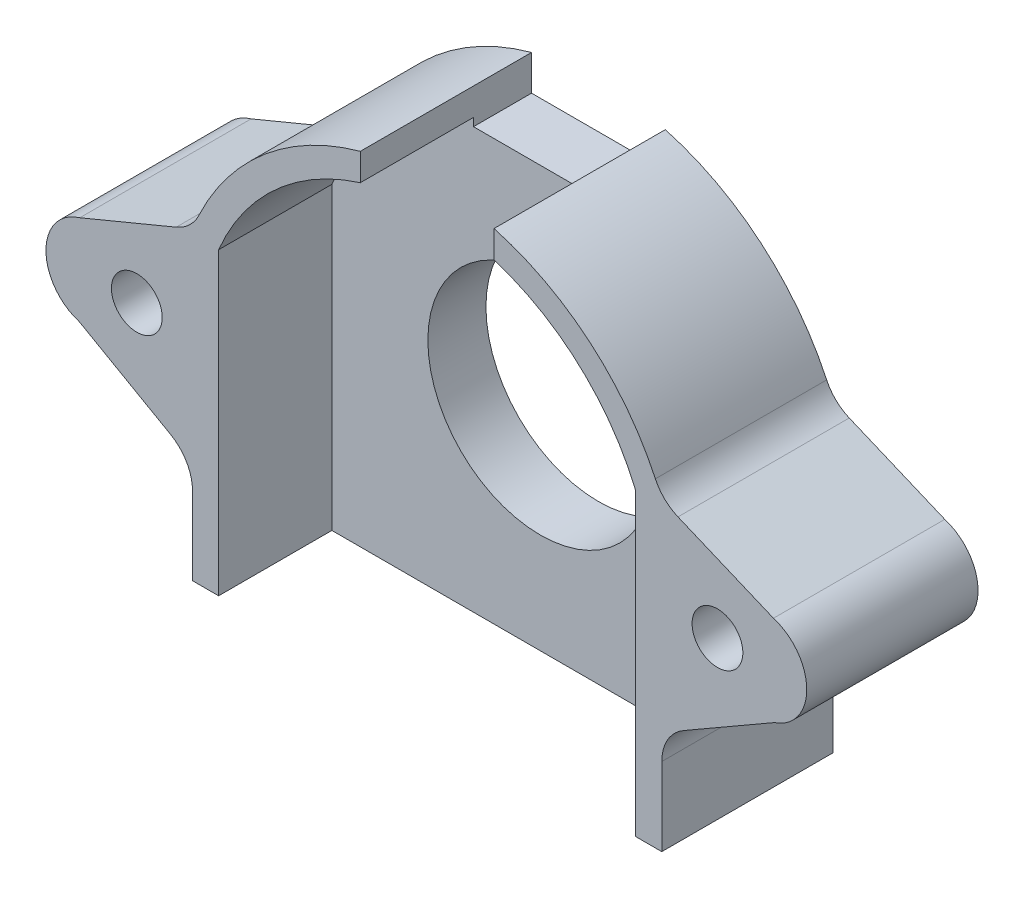
ISO-10303-21;
HEADER;
FILE_DESCRIPTION(('STEP AP214'),'2;1');
FILE_NAME('part.step','',(''),(''),'','','');
FILE_SCHEMA(('AUTOMOTIVE_DESIGN { 1 0 10303 214 1 1 1 1 }'));
ENDSEC;
DATA;
#1=APPLICATION_CONTEXT('core data for automotive mechanical design processes');
#2=APPLICATION_PROTOCOL_DEFINITION('international standard','automotive_design',2000,#1);
#3=PRODUCT_CONTEXT('',#1,'mechanical');
#4=PRODUCT('Part','Part','',(#3));
#5=PRODUCT_RELATED_PRODUCT_CATEGORY('part','',(#4));
#6=PRODUCT_DEFINITION_FORMATION('','',#4);
#7=PRODUCT_DEFINITION_CONTEXT('part definition',#1,'design');
#8=PRODUCT_DEFINITION('design','',#6,#7);
#9=PRODUCT_DEFINITION_SHAPE('','',#8);
#10=(LENGTH_UNIT() NAMED_UNIT(*) SI_UNIT(.MILLI.,.METRE.));
#11=(NAMED_UNIT(*) PLANE_ANGLE_UNIT() SI_UNIT($,.RADIAN.));
#12=(NAMED_UNIT(*) SI_UNIT($,.STERADIAN.) SOLID_ANGLE_UNIT());
#13=UNCERTAINTY_MEASURE_WITH_UNIT(LENGTH_MEASURE(1.E-05),#10,'distance_accuracy_value','');
#14=(GEOMETRIC_REPRESENTATION_CONTEXT(3) GLOBAL_UNCERTAINTY_ASSIGNED_CONTEXT((#13)) GLOBAL_UNIT_ASSIGNED_CONTEXT((#10,
#11,#12)) REPRESENTATION_CONTEXT('',''));
#15=CARTESIAN_POINT('',(0.,0.,0.));
#16=DIRECTION('',(0.,0.,1.));
#17=DIRECTION('',(1.,0.,0.));
#18=AXIS2_PLACEMENT_3D('',#15,#16,#17);
#19=CARTESIAN_POINT('',(-16.1638504935599,6.34296785302776,4.));
#20=DIRECTION('',(1.,0.,0.));
#21=DIRECTION('',(0.,0.,-1.));
#22=AXIS2_PLACEMENT_3D('',#19,#20,#21);
#23=PLANE('',#22);
#24=DIRECTION('',(0.,0.,1.));
#25=VECTOR('',#24,1.);
#26=CARTESIAN_POINT('',(-16.1638504935599,-9.28714517687184,4.));
#27=LINE('',#26,#25);
#28=CARTESIAN_POINT('',(-16.1638504935599,-9.28714517687184,11.8));
#29=VERTEX_POINT('',#28);
#30=CARTESIAN_POINT('',(-16.1638504935599,-9.28714517687184,0.));
#31=VERTEX_POINT('',#30);
#32=EDGE_CURVE('E56',#29,#31,#27,.F.);
#33=ORIENTED_EDGE('',*,*,#32,.T.);
#34=DIRECTION('',(0.,-1.,0.));
#35=VECTOR('',#34,1.);
#36=CARTESIAN_POINT('',(-16.1638504935599,6.34296785302776,0.));
#37=LINE('',#36,#35);
#38=CARTESIAN_POINT('',(-16.1638504935599,-14.6559029883289,0.));
#39=VERTEX_POINT('',#38);
#40=EDGE_CURVE('E193',#31,#39,#37,.T.);
#41=ORIENTED_EDGE('',*,*,#40,.T.);
#42=DIRECTION('',(0.,0.,-1.));
#43=VECTOR('',#42,1.);
#44=CARTESIAN_POINT('',(-16.1638504935599,-14.6559029883289,11.8));
#45=LINE('',#44,#43);
#46=CARTESIAN_POINT('',(-16.1638504935599,-14.6559029883289,11.8));
#47=VERTEX_POINT('',#46);
#48=EDGE_CURVE('E196',#47,#39,#45,.T.);
#49=ORIENTED_EDGE('',*,*,#48,.F.);
#50=DIRECTION('',(0.,-1.,0.));
#51=VECTOR('',#50,1.);
#52=CARTESIAN_POINT('',(-16.1638504935599,6.34296785302776,11.8));
#53=LINE('',#52,#51);
#54=EDGE_CURVE('E364',#29,#47,#53,.T.);
#55=ORIENTED_EDGE('',*,*,#54,.F.);
#56=EDGE_LOOP('',(#33,#41,#49,#55));
#57=FACE_BOUND('',#56,.T.);
#58=ADVANCED_FACE('F33',(#57),#23,.F.);
#59=CARTESIAN_POINT('',(0.,0.,4.));
#60=DIRECTION('',(0.,0.,-1.));
#61=DIRECTION('',(-1.,0.,0.));
#62=AXIS2_PLACEMENT_3D('',#59,#60,#61);
#63=CYLINDRICAL_SURFACE('',#62,17.3638504935599);
#64=DIRECTION('',(0.,0.,-1.));
#65=VECTOR('',#64,1.);
#66=CARTESIAN_POINT('',(15.7225991631552,7.36906910793018,4.));
#67=LINE('',#66,#65);
#68=CARTESIAN_POINT('',(15.7225991631552,7.36906910793018,11.8));
#69=VERTEX_POINT('',#68);
#70=CARTESIAN_POINT('',(15.7225991631552,7.36906910793018,0.));
#71=VERTEX_POINT('',#70);
#72=EDGE_CURVE('E392',#69,#71,#67,.T.);
#73=ORIENTED_EDGE('',*,*,#72,.T.);
#74=CARTESIAN_POINT('',(0.,0.,0.));
#75=DIRECTION('',(0.,0.,1.));
#76=DIRECTION('',(1.,0.,0.));
#77=AXIS2_PLACEMENT_3D('',#74,#75,#76);
#78=CIRCLE('',#77,17.3638504935599);
#79=CARTESIAN_POINT('',(4.6066267409119,16.7416335532891,0.));
#80=VERTEX_POINT('',#79);
#81=EDGE_CURVE('E371',#71,#80,#78,.T.);
#82=ORIENTED_EDGE('',*,*,#81,.T.);
#83=DIRECTION('',(0.,0.,-1.));
#84=VECTOR('',#83,1.);
#85=CARTESIAN_POINT('',(4.6066267409119,16.7416335532891,11.8));
#86=LINE('',#85,#84);
#87=CARTESIAN_POINT('',(4.6066267409119,16.7416335532891,11.8));
#88=VERTEX_POINT('',#87);
#89=EDGE_CURVE('E322',#88,#80,#86,.T.);
#90=ORIENTED_EDGE('',*,*,#89,.F.);
#91=CARTESIAN_POINT('',(0.,0.,11.8));
#92=DIRECTION('',(0.,0.,1.));
#93=DIRECTION('',(1.,0.,0.));
#94=AXIS2_PLACEMENT_3D('',#91,#92,#93);
#95=CIRCLE('',#94,17.3638504935599);
#96=EDGE_CURVE('E359',#69,#88,#95,.T.);
#97=ORIENTED_EDGE('',*,*,#96,.F.);
#98=EDGE_LOOP('',(#73,#82,#90,#97));
#99=FACE_BOUND('',#98,.T.);
#100=ADVANCED_FACE('F424',(#99),#63,.T.);
#101=CARTESIAN_POINT('',(0.,0.,11.8));
#102=DIRECTION('',(0.,0.,1.));
#103=DIRECTION('',(1.,0.,0.));
#104=AXIS2_PLACEMENT_3D('',#101,#102,#103);
#105=PLANE('',#104);
#106=DIRECTION('',(0.,-1.,0.));
#107=VECTOR('',#106,1.);
#108=CARTESIAN_POINT('',(4.6066267409119,14.6569741781302,11.8));
#109=LINE('',#108,#107);
#110=CARTESIAN_POINT('',(4.6066267409119,14.8664868834503,11.8));
#111=VERTEX_POINT('',#110);
#112=EDGE_CURVE('E308',#88,#111,#109,.T.);
#113=ORIENTED_EDGE('',*,*,#112,.T.);
#114=CARTESIAN_POINT('',(0.,0.,11.8));
#115=DIRECTION('',(0.,0.,1.));
#116=DIRECTION('',(1.,0.,0.));
#117=AXIS2_PLACEMENT_3D('',#114,#115,#116);
#118=CIRCLE('',#117,15.5638504935599);
#119=CARTESIAN_POINT('',(14.3638504935599,5.99276573749915,11.8));
#120=VERTEX_POINT('',#119);
#121=EDGE_CURVE('E343',#120,#111,#118,.T.);
#122=ORIENTED_EDGE('',*,*,#121,.F.);
#123=DIRECTION('',(0.,1.,0.));
#124=VECTOR('',#123,1.);
#125=CARTESIAN_POINT('',(14.3638504935599,-12.8327523091671,11.8));
#126=LINE('',#125,#124);
#127=CARTESIAN_POINT('',(14.3638504935599,-14.6559029883289,11.8));
#128=VERTEX_POINT('',#127);
#129=EDGE_CURVE('E341',#128,#120,#126,.T.);
#130=ORIENTED_EDGE('',*,*,#129,.F.);
#131=DIRECTION('',(-1.,0.,0.));
#132=VECTOR('',#131,1.);
#133=CARTESIAN_POINT('',(16.1638504935599,-14.6559029883289,11.8));
#134=LINE('',#133,#132);
#135=CARTESIAN_POINT('',(16.1638504935599,-14.6559029883289,11.8));
#136=VERTEX_POINT('',#135);
#137=EDGE_CURVE('E223',#136,#128,#134,.T.);
#138=ORIENTED_EDGE('',*,*,#137,.F.);
#139=DIRECTION('',(0.,1.,0.));
#140=VECTOR('',#139,1.);
#141=CARTESIAN_POINT('',(16.1638504935599,-14.4243961967111,11.8));
#142=LINE('',#141,#140);
#143=CARTESIAN_POINT('',(16.1638504935599,-9.27696063855388,11.8));
#144=VERTEX_POINT('',#143);
#145=EDGE_CURVE('E366',#136,#144,#142,.T.);
#146=ORIENTED_EDGE('',*,*,#145,.T.);
#147=CARTESIAN_POINT('',(19.1638504935599,-9.27696063855388,11.8));
#148=DIRECTION('',(0.,0.,1.));
#149=DIRECTION('',(1.,0.,0.));
#150=AXIS2_PLACEMENT_3D('',#147,#148,#149);
#151=CIRCLE('',#150,3.);
#152=CARTESIAN_POINT('',(17.6667189928393,-6.67723040840499,11.8));
#153=VERTEX_POINT('',#152);
#154=EDGE_CURVE('E41',#144,#153,#151,.F.);
#155=ORIENTED_EDGE('',*,*,#154,.T.);
#156=DIRECTION('',(0.866576743382963,0.499043833573543,0.));
#157=VECTOR('',#156,1.);
#158=CARTESIAN_POINT('',(16.1638504935599,-7.5427016583135,11.8));
#159=LINE('',#158,#157);
#160=CARTESIAN_POINT('',(23.925870501949,-3.07271299217504,11.8));
#161=VERTEX_POINT('',#160);
#162=EDGE_CURVE('E297',#153,#161,#159,.T.);
#163=ORIENTED_EDGE('',*,*,#162,.T.);
#164=CARTESIAN_POINT('',(22.9022278104594,0.0118705518645778,11.8));
#165=DIRECTION('',(0.,0.,1.));
#166=DIRECTION('',(1.,0.,0.));
#167=AXIS2_PLACEMENT_3D('',#164,#165,#166);
#168=CIRCLE('',#167,3.25000000000001);
#169=CARTESIAN_POINT('',(23.8591950565423,3.11778646990301,11.8));
#170=VERTEX_POINT('',#169);
#171=EDGE_CURVE('E299',#161,#170,#168,.T.);
#172=ORIENTED_EDGE('',*,*,#171,.T.);
#173=DIRECTION('',(-0.922275512084958,0.38653315486311,0.));
#174=VECTOR('',#173,1.);
#175=CARTESIAN_POINT('',(23.8591950565423,3.11778646990301,11.8));
#176=LINE('',#175,#174);
#177=CARTESIAN_POINT('',(17.2794362117091,5.87541682136088,11.8));
#178=VERTEX_POINT('',#177);
#179=EDGE_CURVE('E294',#170,#178,#176,.T.);
#180=ORIENTED_EDGE('',*,*,#179,.T.);
#181=CARTESIAN_POINT('',(18.4390356762984,8.64224335761575,11.8));
#182=DIRECTION('',(0.,0.,1.));
#183=DIRECTION('',(1.,0.,0.));
#184=AXIS2_PLACEMENT_3D('',#181,#182,#183);
#185=CIRCLE('',#184,3.);
#186=EDGE_CURVE('E11',#178,#69,#185,.F.);
#187=ORIENTED_EDGE('',*,*,#186,.T.);
#188=ORIENTED_EDGE('',*,*,#96,.T.);
#189=EDGE_LOOP('',(#113,#122,#130,#138,#146,#155,#163,#172,#180,#187,#188));
#190=FACE_BOUND('',#189,.T.);
#191=CARTESIAN_POINT('',(20.,0.,11.8));
#192=DIRECTION('',(0.,0.,1.));
#193=DIRECTION('',(1.,0.,0.));
#194=AXIS2_PLACEMENT_3D('',#191,#192,#193);
#195=CIRCLE('',#194,1.75);
#196=CARTESIAN_POINT('',(21.75,0.,11.8));
#197=VERTEX_POINT('',#196);
#198=EDGE_CURVE('E289',#197,#197,#195,.T.);
#199=ORIENTED_EDGE('',*,*,#198,.F.);
#200=EDGE_LOOP('',(#199));
#201=FACE_BOUND('',#200,.T.);
#202=ADVANCED_FACE('F401',(#190,#201),#105,.T.);
#203=CARTESIAN_POINT('',(0.,0.,4.));
#204=DIRECTION('',(0.,0.,-1.));
#205=DIRECTION('',(-1.,0.,0.));
#206=AXIS2_PLACEMENT_3D('',#203,#204,#205);
#207=CYLINDRICAL_SURFACE('',#206,17.3638504935599);
#208=CARTESIAN_POINT('',(0.,0.,0.));
#209=DIRECTION('',(0.,0.,1.));
#210=DIRECTION('',(1.,0.,0.));
#211=AXIS2_PLACEMENT_3D('',#208,#209,#210);
#212=CIRCLE('',#211,17.3638504935599);
#213=CARTESIAN_POINT('',(-4.6066267409119,16.7416335532891,0.));
#214=VERTEX_POINT('',#213);
#215=CARTESIAN_POINT('',(-15.7204816007306,7.37358543747817,0.));
#216=VERTEX_POINT('',#215);
#217=EDGE_CURVE('E201',#214,#216,#212,.T.);
#218=ORIENTED_EDGE('',*,*,#217,.T.);
#219=DIRECTION('',(0.,0.,-1.));
#220=VECTOR('',#219,1.);
#221=CARTESIAN_POINT('',(-15.7204816007306,7.37358543747817,4.));
#222=LINE('',#221,#220);
#223=CARTESIAN_POINT('',(-15.7204816007306,7.37358543747817,11.8));
#224=VERTEX_POINT('',#223);
#225=EDGE_CURVE('E48',#216,#224,#222,.F.);
#226=ORIENTED_EDGE('',*,*,#225,.T.);
#227=CARTESIAN_POINT('',(0.,0.,11.8));
#228=DIRECTION('',(0.,0.,1.));
#229=DIRECTION('',(1.,0.,0.));
#230=AXIS2_PLACEMENT_3D('',#227,#228,#229);
#231=CIRCLE('',#230,17.3638504935599);
#232=CARTESIAN_POINT('',(-4.6066267409119,16.7416335532891,11.8));
#233=VERTEX_POINT('',#232);
#234=EDGE_CURVE('E361',#233,#224,#231,.T.);
#235=ORIENTED_EDGE('',*,*,#234,.F.);
#236=DIRECTION('',(0.,0.,-1.));
#237=VECTOR('',#236,1.);
#238=CARTESIAN_POINT('',(-4.6066267409119,16.7416335532891,11.8));
#239=LINE('',#238,#237);
#240=EDGE_CURVE('E326',#233,#214,#239,.T.);
#241=ORIENTED_EDGE('',*,*,#240,.T.);
#242=EDGE_LOOP('',(#218,#226,#235,#241));
#243=FACE_BOUND('',#242,.T.);
#244=ADVANCED_FACE('F447',(#243),#207,.T.);
#245=CARTESIAN_POINT('',(16.1638504935599,-14.4243961967111,4.));
#246=DIRECTION('',(-1.,0.,0.));
#247=DIRECTION('',(0.,0.,1.));
#248=AXIS2_PLACEMENT_3D('',#245,#246,#247);
#249=PLANE('',#248);
#250=DIRECTION('',(0.,1.,0.));
#251=VECTOR('',#250,1.);
#252=CARTESIAN_POINT('',(16.1638504935599,-14.4243961967111,0.));
#253=LINE('',#252,#251);
#254=CARTESIAN_POINT('',(16.1638504935599,-14.6559029883289,0.));
#255=VERTEX_POINT('',#254);
#256=CARTESIAN_POINT('',(16.1638504935599,-9.27696063855388,0.));
#257=VERTEX_POINT('',#256);
#258=EDGE_CURVE('E200',#255,#257,#253,.T.);
#259=ORIENTED_EDGE('',*,*,#258,.T.);
#260=DIRECTION('',(0.,0.,1.));
#261=VECTOR('',#260,1.);
#262=CARTESIAN_POINT('',(16.1638504935599,-9.27696063855388,4.));
#263=LINE('',#262,#261);
#264=EDGE_CURVE('E387',#257,#144,#263,.T.);
#265=ORIENTED_EDGE('',*,*,#264,.T.);
#266=ORIENTED_EDGE('',*,*,#145,.F.);
#267=DIRECTION('',(0.,0.,1.));
#268=VECTOR('',#267,1.);
#269=CARTESIAN_POINT('',(16.1638504935599,-14.6559029883289,0.));
#270=LINE('',#269,#268);
#271=EDGE_CURVE('E213',#255,#136,#270,.T.);
#272=ORIENTED_EDGE('',*,*,#271,.F.);
#273=EDGE_LOOP('',(#259,#265,#266,#272));
#274=FACE_BOUND('',#273,.T.);
#275=ADVANCED_FACE('F445',(#274),#249,.F.);
#276=CARTESIAN_POINT('',(0.,0.,0.));
#277=DIRECTION('',(0.,0.,1.));
#278=DIRECTION('',(1.,0.,0.));
#279=AXIS2_PLACEMENT_3D('',#276,#277,#278);
#280=PLANE('',#279);
#281=CARTESIAN_POINT('',(-18.4365522568149,8.64753998578754,0.));
#282=DIRECTION('',(0.,0.,1.));
#283=DIRECTION('',(1.,0.,0.));
#284=AXIS2_PLACEMENT_3D('',#281,#282,#283);
#285=CIRCLE('',#284,3.);
#286=CARTESIAN_POINT('',(-17.2859329859879,5.87696688738322,0.));
#287=VERTEX_POINT('',#286);
#288=EDGE_CURVE('E246',#216,#287,#285,.F.);
#289=ORIENTED_EDGE('',*,*,#288,.F.);
#290=ORIENTED_EDGE('',*,*,#217,.F.);
#291=DIRECTION('',(0.,1.,0.));
#292=VECTOR('',#291,1.);
#293=CARTESIAN_POINT('',(-4.6066267409119,14.6569741781302,0.));
#294=LINE('',#293,#292);
#295=CARTESIAN_POINT('',(-4.6066267409119,14.3116737169413,0.));
#296=VERTEX_POINT('',#295);
#297=EDGE_CURVE('E318',#296,#214,#294,.T.);
#298=ORIENTED_EDGE('',*,*,#297,.F.);
#299=DIRECTION('',(-1.,0.,0.));
#300=VECTOR('',#299,1.);
#301=CARTESIAN_POINT('',(4.6066267409119,14.3116737169413,0.));
#302=LINE('',#301,#300);
#303=CARTESIAN_POINT('',(4.6066267409119,14.3116737169413,0.));
#304=VERTEX_POINT('',#303);
#305=EDGE_CURVE('E305',#304,#296,#302,.T.);
#306=ORIENTED_EDGE('',*,*,#305,.F.);
#307=DIRECTION('',(0.,-1.,0.));
#308=VECTOR('',#307,1.);
#309=CARTESIAN_POINT('',(4.6066267409119,14.6569741781302,0.));
#310=LINE('',#309,#308);
#311=EDGE_CURVE('E312',#80,#304,#310,.T.);
#312=ORIENTED_EDGE('',*,*,#311,.F.);
#313=ORIENTED_EDGE('',*,*,#81,.F.);
#314=CARTESIAN_POINT('',(18.4390356762984,8.64224335761575,0.));
#315=DIRECTION('',(0.,0.,1.));
#316=DIRECTION('',(1.,0.,0.));
#317=AXIS2_PLACEMENT_3D('',#314,#315,#316);
#318=CIRCLE('',#317,3.);
#319=CARTESIAN_POINT('',(17.2794362117091,5.87541682136088,0.));
#320=VERTEX_POINT('',#319);
#321=EDGE_CURVE('E251',#320,#71,#318,.F.);
#322=ORIENTED_EDGE('',*,*,#321,.F.);
#323=DIRECTION('',(-0.922275512084958,0.38653315486311,0.));
#324=VECTOR('',#323,1.);
#325=CARTESIAN_POINT('',(17.2794362117091,5.87541682136088,0.));
#326=LINE('',#325,#324);
#327=CARTESIAN_POINT('',(23.8591950565423,3.11778646990301,0.));
#328=VERTEX_POINT('',#327);
#329=EDGE_CURVE('E254',#328,#320,#326,.T.);
#330=ORIENTED_EDGE('',*,*,#329,.F.);
#331=CARTESIAN_POINT('',(22.9022278104594,0.0118705518645778,0.));
#332=DIRECTION('',(0.,0.,1.));
#333=DIRECTION('',(1.,0.,0.));
#334=AXIS2_PLACEMENT_3D('',#331,#332,#333);
#335=CIRCLE('',#334,3.25000000000001);
#336=CARTESIAN_POINT('',(23.925870501949,-3.07271299217504,0.));
#337=VERTEX_POINT('',#336);
#338=EDGE_CURVE('E257',#337,#328,#335,.T.);
#339=ORIENTED_EDGE('',*,*,#338,.F.);
#340=DIRECTION('',(0.866576743382964,0.499043833573543,0.));
#341=VECTOR('',#340,1.);
#342=CARTESIAN_POINT('',(23.925870501949,-3.07271299217504,0.));
#343=LINE('',#342,#341);
#344=CARTESIAN_POINT('',(17.6667189928393,-6.67723040840499,0.));
#345=VERTEX_POINT('',#344);
#346=EDGE_CURVE('E260',#345,#337,#343,.T.);
#347=ORIENTED_EDGE('',*,*,#346,.F.);
#348=CARTESIAN_POINT('',(19.1638504935599,-9.27696063855388,0.));
#349=DIRECTION('',(0.,0.,1.));
#350=DIRECTION('',(1.,0.,0.));
#351=AXIS2_PLACEMENT_3D('',#348,#349,#350);
#352=CIRCLE('',#351,3.);
#353=EDGE_CURVE('E263',#257,#345,#352,.F.);
#354=ORIENTED_EDGE('',*,*,#353,.F.);
#355=ORIENTED_EDGE('',*,*,#258,.F.);
#356=DIRECTION('',(1.,0.,0.));
#357=VECTOR('',#356,1.);
#358=CARTESIAN_POINT('',(-16.1638504935599,-14.6559029883289,0.));
#359=LINE('',#358,#357);
#360=EDGE_CURVE('E204',#39,#255,#359,.T.);
#361=ORIENTED_EDGE('',*,*,#360,.F.);
#362=ORIENTED_EDGE('',*,*,#40,.F.);
#363=CARTESIAN_POINT('',(-19.1638504935599,-9.28714517687184,0.));
#364=DIRECTION('',(0.,0.,1.));
#365=DIRECTION('',(1.,0.,0.));
#366=AXIS2_PLACEMENT_3D('',#363,#364,#365);
#367=CIRCLE('',#366,3.);
#368=CARTESIAN_POINT('',(-17.6799488920706,-6.67984081468135,0.));
#369=VERTEX_POINT('',#368);
#370=EDGE_CURVE('E235',#369,#31,#367,.F.);
#371=ORIENTED_EDGE('',*,*,#370,.F.);
#372=DIRECTION('',(0.869101454063499,-0.494633867163089,0.));
#373=VECTOR('',#372,1.);
#374=CARTESIAN_POINT('',(-17.6799488920706,-6.67984081468134,0.));
#375=LINE('',#374,#373);
#376=CARTESIAN_POINT('',(-23.9484846038936,-3.11221353009693,0.));
#377=VERTEX_POINT('',#376);
#378=EDGE_CURVE('E237',#377,#369,#375,.T.);
#379=ORIENTED_EDGE('',*,*,#378,.F.);
#380=CARTESIAN_POINT('',(-23.012201023411,0.,0.));
#381=DIRECTION('',(0.,0.,1.));
#382=DIRECTION('',(1.,0.,0.));
#383=AXIS2_PLACEMENT_3D('',#380,#381,#382);
#384=CIRCLE('',#383,3.25);
#385=CARTESIAN_POINT('',(-23.9297562141706,3.11778646990307,0.));
#386=VERTEX_POINT('',#385);
#387=EDGE_CURVE('E240',#386,#377,#384,.T.);
#388=ORIENTED_EDGE('',*,*,#387,.F.);
#389=DIRECTION('',(-0.923524366134774,-0.383539756942308,0.));
#390=VECTOR('',#389,1.);
#391=CARTESIAN_POINT('',(-23.9297562141706,3.11778646990307,0.));
#392=LINE('',#391,#390);
#393=EDGE_CURVE('E243',#287,#386,#392,.T.);
#394=ORIENTED_EDGE('',*,*,#393,.F.);
#395=EDGE_LOOP('',(#289,#290,#298,#306,#312,#313,#322,#330,#339,#347,#354,#355,#361,#362,#371,
#379,#388,#394));
#396=FACE_BOUND('',#395,.T.);
#397=CARTESIAN_POINT('',(0.,0.,0.));
#398=DIRECTION('',(0.,0.,-1.));
#399=DIRECTION('',(-1.,0.,0.));
#400=AXIS2_PLACEMENT_3D('',#397,#398,#399);
#401=CIRCLE('',#400,7.7500000000001);
#402=CARTESIAN_POINT('',(-7.7500000000001,0.,0.));
#403=VERTEX_POINT('',#402);
#404=EDGE_CURVE('E270',#403,#403,#401,.T.);
#405=ORIENTED_EDGE('',*,*,#404,.F.);
#406=EDGE_LOOP('',(#405));
#407=FACE_BOUND('',#406,.T.);
#408=CARTESIAN_POINT('',(20.,0.,0.));
#409=DIRECTION('',(0.,0.,1.));
#410=DIRECTION('',(1.,0.,0.));
#411=AXIS2_PLACEMENT_3D('',#408,#409,#410);
#412=CIRCLE('',#411,1.75);
#413=CARTESIAN_POINT('',(21.75,0.,0.));
#414=VERTEX_POINT('',#413);
#415=EDGE_CURVE('E266',#414,#414,#412,.T.);
#416=ORIENTED_EDGE('',*,*,#415,.T.);
#417=EDGE_LOOP('',(#416));
#418=FACE_BOUND('',#417,.T.);
#419=CARTESIAN_POINT('',(-20.,0.,0.));
#420=DIRECTION('',(0.,0.,1.));
#421=DIRECTION('',(1.,0.,0.));
#422=AXIS2_PLACEMENT_3D('',#419,#420,#421);
#423=CIRCLE('',#422,1.75);
#424=CARTESIAN_POINT('',(-18.25,0.,0.));
#425=VERTEX_POINT('',#424);
#426=EDGE_CURVE('E248',#425,#425,#423,.T.);
#427=ORIENTED_EDGE('',*,*,#426,.T.);
#428=EDGE_LOOP('',(#427));
#429=FACE_BOUND('',#428,.T.);
#430=ADVANCED_FACE('F206',(#396,#407,#418,#429),#280,.F.);
#431=DIRECTION('',(0.,1.,0.));
#432=VECTOR('',#431,1.);
#433=CARTESIAN_POINT('',(-4.6066267409119,14.3116737169413,11.8));
#434=LINE('',#433,#432);
#435=CARTESIAN_POINT('',(-4.6066267409119,14.8664868834503,11.8));
#436=VERTEX_POINT('',#435);
#437=EDGE_CURVE('E311',#436,#233,#434,.T.);
#438=ORIENTED_EDGE('',*,*,#437,.T.);
#439=ORIENTED_EDGE('',*,*,#234,.T.);
#440=CARTESIAN_POINT('',(-18.4365522568149,8.64753998578754,11.8));
#441=DIRECTION('',(0.,0.,1.));
#442=DIRECTION('',(1.,0.,0.));
#443=AXIS2_PLACEMENT_3D('',#440,#441,#442);
#444=CIRCLE('',#443,3.);
#445=CARTESIAN_POINT('',(-17.2859329859879,5.87696688738322,11.8));
#446=VERTEX_POINT('',#445);
#447=EDGE_CURVE('E396',#224,#446,#444,.F.);
#448=ORIENTED_EDGE('',*,*,#447,.T.);
#449=DIRECTION('',(-0.923524366134774,-0.383539756942308,0.));
#450=VECTOR('',#449,1.);
#451=CARTESIAN_POINT('',(-16.1638504935599,6.34296785302776,11.8));
#452=LINE('',#451,#450);
#453=CARTESIAN_POINT('',(-23.9297562141706,3.11778646990307,11.8));
#454=VERTEX_POINT('',#453);
#455=EDGE_CURVE('E281',#446,#454,#452,.T.);
#456=ORIENTED_EDGE('',*,*,#455,.T.);
#457=CARTESIAN_POINT('',(-23.012201023411,0.,11.8));
#458=DIRECTION('',(0.,0.,1.));
#459=DIRECTION('',(1.,0.,0.));
#460=AXIS2_PLACEMENT_3D('',#457,#458,#459);
#461=CIRCLE('',#460,3.25);
#462=CARTESIAN_POINT('',(-23.9484846038936,-3.11221353009693,11.8));
#463=VERTEX_POINT('',#462);
#464=EDGE_CURVE('E283',#454,#463,#461,.T.);
#465=ORIENTED_EDGE('',*,*,#464,.T.);
#466=DIRECTION('',(0.869101454063499,-0.494633867163089,0.));
#467=VECTOR('',#466,1.);
#468=CARTESIAN_POINT('',(-23.9484846038936,-3.11221353009693,11.8));
#469=LINE('',#468,#467);
#470=CARTESIAN_POINT('',(-17.6799488920706,-6.67984081468134,11.8));
#471=VERTEX_POINT('',#470);
#472=EDGE_CURVE('E278',#463,#471,#469,.T.);
#473=ORIENTED_EDGE('',*,*,#472,.T.);
#474=CARTESIAN_POINT('',(-19.1638504935599,-9.28714517687184,11.8));
#475=DIRECTION('',(0.,0.,1.));
#476=DIRECTION('',(1.,0.,0.));
#477=AXIS2_PLACEMENT_3D('',#474,#475,#476);
#478=CIRCLE('',#477,3.);
#479=EDGE_CURVE('E398',#471,#29,#478,.F.);
#480=ORIENTED_EDGE('',*,*,#479,.T.);
#481=ORIENTED_EDGE('',*,*,#54,.T.);
#482=DIRECTION('',(-1.,0.,0.));
#483=VECTOR('',#482,1.);
#484=CARTESIAN_POINT('',(-14.3638504935599,-14.6559029883289,11.8));
#485=LINE('',#484,#483);
#486=CARTESIAN_POINT('',(-14.3638504935599,-14.6559029883289,11.8));
#487=VERTEX_POINT('',#486);
#488=EDGE_CURVE('E219',#487,#47,#485,.T.);
#489=ORIENTED_EDGE('',*,*,#488,.F.);
#490=DIRECTION('',(0.,-1.,0.));
#491=VECTOR('',#490,1.);
#492=CARTESIAN_POINT('',(-14.3638504935599,5.99276573749915,11.8));
#493=LINE('',#492,#491);
#494=CARTESIAN_POINT('',(-14.3638504935599,5.99276573749915,11.8));
#495=VERTEX_POINT('',#494);
#496=EDGE_CURVE('E338',#495,#487,#493,.T.);
#497=ORIENTED_EDGE('',*,*,#496,.F.);
#498=CARTESIAN_POINT('',(0.,0.,11.8));
#499=DIRECTION('',(0.,0.,1.));
#500=DIRECTION('',(1.,0.,0.));
#501=AXIS2_PLACEMENT_3D('',#498,#499,#500);
#502=CIRCLE('',#501,15.5638504935599);
#503=EDGE_CURVE('E336',#436,#495,#502,.T.);
#504=ORIENTED_EDGE('',*,*,#503,.F.);
#505=EDGE_LOOP('',(#438,#439,#448,#456,#465,#473,#480,#481,#489,#497,#504));
#506=FACE_BOUND('',#505,.T.);
#507=CARTESIAN_POINT('',(-20.,0.,11.8));
#508=DIRECTION('',(0.,0.,1.));
#509=DIRECTION('',(1.,0.,0.));
#510=AXIS2_PLACEMENT_3D('',#507,#508,#509);
#511=CIRCLE('',#510,1.75);
#512=CARTESIAN_POINT('',(-18.25,0.,11.8));
#513=VERTEX_POINT('',#512);
#514=EDGE_CURVE('E273',#513,#513,#511,.T.);
#515=ORIENTED_EDGE('',*,*,#514,.F.);
#516=EDGE_LOOP('',(#515));
#517=FACE_BOUND('',#516,.T.);
#518=ADVANCED_FACE('F453',(#506,#517),#105,.T.);
#519=CARTESIAN_POINT('',(0.,0.,11.8));
#520=DIRECTION('',(0.,0.,-1.));
#521=DIRECTION('',(-1.,0.,0.));
#522=AXIS2_PLACEMENT_3D('',#519,#520,#521);
#523=CYLINDRICAL_SURFACE('',#522,15.5638504935599);
#524=DIRECTION('',(0.,0.,-1.));
#525=VECTOR('',#524,1.);
#526=CARTESIAN_POINT('',(-4.6066267409119,14.8664868834503,11.8));
#527=LINE('',#526,#525);
#528=CARTESIAN_POINT('',(-4.6066267409119,14.8664868834503,4.));
#529=VERTEX_POINT('',#528);
#530=EDGE_CURVE('E325',#436,#529,#527,.T.);
#531=ORIENTED_EDGE('',*,*,#530,.F.);
#532=ORIENTED_EDGE('',*,*,#503,.T.);
#533=DIRECTION('',(0.,0.,-1.));
#534=VECTOR('',#533,1.);
#535=CARTESIAN_POINT('',(-14.3638504935599,5.99276573749915,11.8));
#536=LINE('',#535,#534);
#537=CARTESIAN_POINT('',(-14.3638504935599,5.99276573749915,4.));
#538=VERTEX_POINT('',#537);
#539=EDGE_CURVE('E356',#495,#538,#536,.T.);
#540=ORIENTED_EDGE('',*,*,#539,.T.);
#541=CARTESIAN_POINT('',(0.,0.,4.));
#542=DIRECTION('',(0.,0.,1.));
#543=DIRECTION('',(1.,0.,0.));
#544=AXIS2_PLACEMENT_3D('',#541,#542,#543);
#545=CIRCLE('',#544,15.5638504935599);
#546=EDGE_CURVE('E335',#529,#538,#545,.T.);
#547=ORIENTED_EDGE('',*,*,#546,.F.);
#548=EDGE_LOOP('',(#531,#532,#540,#547));
#549=FACE_BOUND('',#548,.T.);
#550=ADVANCED_FACE('F532',(#549),#523,.F.);
#551=CARTESIAN_POINT('',(-14.3638504935599,5.99276573749915,11.8));
#552=DIRECTION('',(1.,0.,0.));
#553=DIRECTION('',(0.,0.,-1.));
#554=AXIS2_PLACEMENT_3D('',#551,#552,#553);
#555=PLANE('',#554);
#556=ORIENTED_EDGE('',*,*,#496,.T.);
#557=DIRECTION('',(0.,0.,1.));
#558=VECTOR('',#557,1.);
#559=CARTESIAN_POINT('',(-14.3638504935599,-14.6559029883289,4.));
#560=LINE('',#559,#558);
#561=CARTESIAN_POINT('',(-14.3638504935599,-14.6559029883289,4.));
#562=VERTEX_POINT('',#561);
#563=EDGE_CURVE('E232',#562,#487,#560,.T.);
#564=ORIENTED_EDGE('',*,*,#563,.F.);
#565=DIRECTION('',(0.,-1.,0.));
#566=VECTOR('',#565,1.);
#567=CARTESIAN_POINT('',(-14.3638504935599,5.99276573749915,4.));
#568=LINE('',#567,#566);
#569=EDGE_CURVE('E348',#538,#562,#568,.T.);
#570=ORIENTED_EDGE('',*,*,#569,.F.);
#571=ORIENTED_EDGE('',*,*,#539,.F.);
#572=EDGE_LOOP('',(#556,#564,#570,#571));
#573=FACE_BOUND('',#572,.T.);
#574=ADVANCED_FACE('F529',(#573),#555,.T.);
#575=CARTESIAN_POINT('',(14.3638504935599,-12.8327523091671,11.8));
#576=DIRECTION('',(-1.,0.,0.));
#577=DIRECTION('',(0.,0.,1.));
#578=AXIS2_PLACEMENT_3D('',#575,#576,#577);
#579=PLANE('',#578);
#580=DIRECTION('',(0.,1.,0.));
#581=VECTOR('',#580,1.);
#582=CARTESIAN_POINT('',(14.3638504935599,-12.8327523091671,4.));
#583=LINE('',#582,#581);
#584=CARTESIAN_POINT('',(14.3638504935599,-14.6559029883289,4.));
#585=VERTEX_POINT('',#584);
#586=CARTESIAN_POINT('',(14.3638504935599,5.99276573749915,4.));
#587=VERTEX_POINT('',#586);
#588=EDGE_CURVE('E350',#585,#587,#583,.T.);
#589=ORIENTED_EDGE('',*,*,#588,.F.);
#590=DIRECTION('',(0.,0.,-1.));
#591=VECTOR('',#590,1.);
#592=CARTESIAN_POINT('',(14.3638504935599,-14.6559029883289,11.8));
#593=LINE('',#592,#591);
#594=EDGE_CURVE('E226',#128,#585,#593,.T.);
#595=ORIENTED_EDGE('',*,*,#594,.F.);
#596=ORIENTED_EDGE('',*,*,#129,.T.);
#597=DIRECTION('',(0.,0.,-1.));
#598=VECTOR('',#597,1.);
#599=CARTESIAN_POINT('',(14.3638504935599,5.99276573749915,11.8));
#600=LINE('',#599,#598);
#601=EDGE_CURVE('E346',#120,#587,#600,.T.);
#602=ORIENTED_EDGE('',*,*,#601,.T.);
#603=EDGE_LOOP('',(#589,#595,#596,#602));
#604=FACE_BOUND('',#603,.T.);
#605=ADVANCED_FACE('F441',(#604),#579,.T.);
#606=CARTESIAN_POINT('',(0.,0.,11.8));
#607=DIRECTION('',(0.,0.,-1.));
#608=DIRECTION('',(-1.,0.,0.));
#609=AXIS2_PLACEMENT_3D('',#606,#607,#608);
#610=CYLINDRICAL_SURFACE('',#609,15.5638504935599);
#611=DIRECTION('',(0.,0.,-1.));
#612=VECTOR('',#611,1.);
#613=CARTESIAN_POINT('',(4.6066267409119,14.8664868834503,11.8));
#614=LINE('',#613,#612);
#615=CARTESIAN_POINT('',(4.6066267409119,14.8664868834503,4.));
#616=VERTEX_POINT('',#615);
#617=EDGE_CURVE('E333',#616,#111,#614,.F.);
#618=ORIENTED_EDGE('',*,*,#617,.F.);
#619=CARTESIAN_POINT('',(0.,0.,4.));
#620=DIRECTION('',(0.,0.,1.));
#621=DIRECTION('',(1.,0.,0.));
#622=AXIS2_PLACEMENT_3D('',#619,#620,#621);
#623=CIRCLE('',#622,15.5638504935599);
#624=EDGE_CURVE('E339',#587,#616,#623,.T.);
#625=ORIENTED_EDGE('',*,*,#624,.F.);
#626=ORIENTED_EDGE('',*,*,#601,.F.);
#627=ORIENTED_EDGE('',*,*,#121,.T.);
#628=EDGE_LOOP('',(#618,#625,#626,#627));
#629=FACE_BOUND('',#628,.T.);
#630=ADVANCED_FACE('F438',(#629),#610,.F.);
#631=CARTESIAN_POINT('',(0.,0.,4.));
#632=DIRECTION('',(0.,0.,1.));
#633=DIRECTION('',(1.,0.,0.));
#634=AXIS2_PLACEMENT_3D('',#631,#632,#633);
#635=PLANE('',#634);
#636=CARTESIAN_POINT('',(0.,0.,4.));
#637=DIRECTION('',(0.,0.,1.));
#638=DIRECTION('',(1.,0.,0.));
#639=AXIS2_PLACEMENT_3D('',#636,#637,#638);
#640=CIRCLE('',#639,7.7500000000001);
#641=CARTESIAN_POINT('',(7.7500000000001,0.,4.));
#642=VERTEX_POINT('',#641);
#643=EDGE_CURVE('E269',#642,#642,#640,.F.);
#644=ORIENTED_EDGE('',*,*,#643,.T.);
#645=EDGE_LOOP('',(#644));
#646=FACE_BOUND('',#645,.T.);
#647=DIRECTION('',(0.,1.,0.));
#648=VECTOR('',#647,1.);
#649=CARTESIAN_POINT('',(4.6066267409119,0.,4.));
#650=LINE('',#649,#648);
#651=CARTESIAN_POINT('',(4.6066267409119,14.3116737169413,4.));
#652=VERTEX_POINT('',#651);
#653=EDGE_CURVE('E378',#652,#616,#650,.T.);
#654=ORIENTED_EDGE('',*,*,#653,.F.);
#655=DIRECTION('',(1.,0.,0.));
#656=VECTOR('',#655,1.);
#657=CARTESIAN_POINT('',(0.,14.3116737169413,4.));
#658=LINE('',#657,#656);
#659=CARTESIAN_POINT('',(-4.6066267409119,14.3116737169413,4.));
#660=VERTEX_POINT('',#659);
#661=EDGE_CURVE('E373',#660,#652,#658,.T.);
#662=ORIENTED_EDGE('',*,*,#661,.F.);
#663=DIRECTION('',(0.,-1.,0.));
#664=VECTOR('',#663,1.);
#665=CARTESIAN_POINT('',(-4.6066267409119,0.,4.));
#666=LINE('',#665,#664);
#667=EDGE_CURVE('E375',#529,#660,#666,.T.);
#668=ORIENTED_EDGE('',*,*,#667,.F.);
#669=ORIENTED_EDGE('',*,*,#546,.T.);
#670=ORIENTED_EDGE('',*,*,#569,.T.);
#671=DIRECTION('',(-1.,0.,0.));
#672=VECTOR('',#671,1.);
#673=CARTESIAN_POINT('',(14.3638504935599,-14.6559029883289,4.));
#674=LINE('',#673,#672);
#675=EDGE_CURVE('E229',#585,#562,#674,.T.);
#676=ORIENTED_EDGE('',*,*,#675,.F.);
#677=ORIENTED_EDGE('',*,*,#588,.T.);
#678=ORIENTED_EDGE('',*,*,#624,.T.);
#679=EDGE_LOOP('',(#654,#662,#668,#669,#670,#676,#677,#678));
#680=FACE_BOUND('',#679,.T.);
#681=ADVANCED_FACE('F518',(#646,#680),#635,.T.);
#682=CARTESIAN_POINT('',(4.6066267409119,14.6569741781302,11.8));
#683=DIRECTION('',(1.,0.,0.));
#684=DIRECTION('',(0.,0.,-1.));
#685=AXIS2_PLACEMENT_3D('',#682,#683,#684);
#686=PLANE('',#685);
#687=ORIENTED_EDGE('',*,*,#617,.T.);
#688=ORIENTED_EDGE('',*,*,#112,.F.);
#689=ORIENTED_EDGE('',*,*,#89,.T.);
#690=ORIENTED_EDGE('',*,*,#311,.T.);
#691=DIRECTION('',(0.,0.,-1.));
#692=VECTOR('',#691,1.);
#693=CARTESIAN_POINT('',(4.6066267409119,14.3116737169413,11.8));
#694=LINE('',#693,#692);
#695=EDGE_CURVE('E315',#652,#304,#694,.T.);
#696=ORIENTED_EDGE('',*,*,#695,.F.);
#697=ORIENTED_EDGE('',*,*,#653,.T.);
#698=EDGE_LOOP('',(#687,#688,#689,#690,#696,#697));
#699=FACE_BOUND('',#698,.T.);
#700=ADVANCED_FACE('F431',(#699),#686,.F.);
#701=CARTESIAN_POINT('',(-4.6066267409119,14.6569741781302,11.8));
#702=DIRECTION('',(-1.,0.,0.));
#703=DIRECTION('',(0.,0.,1.));
#704=AXIS2_PLACEMENT_3D('',#701,#702,#703);
#705=PLANE('',#704);
#706=ORIENTED_EDGE('',*,*,#530,.T.);
#707=ORIENTED_EDGE('',*,*,#667,.T.);
#708=DIRECTION('',(0.,0.,-1.));
#709=VECTOR('',#708,1.);
#710=CARTESIAN_POINT('',(-4.6066267409119,14.3116737169413,11.8));
#711=LINE('',#710,#709);
#712=EDGE_CURVE('E329',#660,#296,#711,.T.);
#713=ORIENTED_EDGE('',*,*,#712,.T.);
#714=ORIENTED_EDGE('',*,*,#297,.T.);
#715=ORIENTED_EDGE('',*,*,#240,.F.);
#716=ORIENTED_EDGE('',*,*,#437,.F.);
#717=EDGE_LOOP('',(#706,#707,#713,#714,#715,#716));
#718=FACE_BOUND('',#717,.T.);
#719=ADVANCED_FACE('F517',(#718),#705,.F.);
#720=CARTESIAN_POINT('',(4.6066267409119,14.3116737169413,11.8));
#721=DIRECTION('',(0.,-1.,0.));
#722=DIRECTION('',(0.,0.,-1.));
#723=AXIS2_PLACEMENT_3D('',#720,#721,#722);
#724=PLANE('',#723);
#725=ORIENTED_EDGE('',*,*,#661,.T.);
#726=ORIENTED_EDGE('',*,*,#695,.T.);
#727=ORIENTED_EDGE('',*,*,#305,.T.);
#728=ORIENTED_EDGE('',*,*,#712,.F.);
#729=EDGE_LOOP('',(#725,#726,#727,#728));
#730=FACE_BOUND('',#729,.T.);
#731=ADVANCED_FACE('F514',(#730),#724,.F.);
#732=CARTESIAN_POINT('',(23.8591950565423,3.11778646990301,8.8));
#733=DIRECTION('',(0.38653315486311,0.922275512084958,0.));
#734=DIRECTION('',(-0.922275512084958,0.38653315486311,0.));
#735=AXIS2_PLACEMENT_3D('',#732,#733,#734);
#736=PLANE('',#735);
#737=DIRECTION('',(0.,0.,1.));
#738=VECTOR('',#737,1.);
#739=CARTESIAN_POINT('',(23.8591950565423,3.11778646990301,8.8));
#740=LINE('',#739,#738);
#741=EDGE_CURVE('E303',#328,#170,#740,.T.);
#742=ORIENTED_EDGE('',*,*,#741,.F.);
#743=ORIENTED_EDGE('',*,*,#329,.T.);
#744=DIRECTION('',(0.,0.,-1.));
#745=VECTOR('',#744,1.);
#746=CARTESIAN_POINT('',(17.2794362117091,5.87541682136088,8.8));
#747=LINE('',#746,#745);
#748=EDGE_CURVE('E394',#320,#178,#747,.F.);
#749=ORIENTED_EDGE('',*,*,#748,.T.);
#750=ORIENTED_EDGE('',*,*,#179,.F.);
#751=EDGE_LOOP('',(#742,#743,#749,#750));
#752=FACE_BOUND('',#751,.T.);
#753=ADVANCED_FACE('F509',(#752),#736,.T.);
#754=CARTESIAN_POINT('',(22.9022278104594,0.0118705518645778,8.8));
#755=DIRECTION('',(0.,0.,1.));
#756=DIRECTION('',(1.,0.,0.));
#757=AXIS2_PLACEMENT_3D('',#754,#755,#756);
#758=CYLINDRICAL_SURFACE('',#757,3.25000000000001);
#759=ORIENTED_EDGE('',*,*,#171,.F.);
#760=DIRECTION('',(0.,0.,1.));
#761=VECTOR('',#760,1.);
#762=CARTESIAN_POINT('',(23.925870501949,-3.07271299217504,8.8));
#763=LINE('',#762,#761);
#764=EDGE_CURVE('E302',#337,#161,#763,.T.);
#765=ORIENTED_EDGE('',*,*,#764,.F.);
#766=ORIENTED_EDGE('',*,*,#338,.T.);
#767=ORIENTED_EDGE('',*,*,#741,.T.);
#768=EDGE_LOOP('',(#759,#765,#766,#767));
#769=FACE_BOUND('',#768,.T.);
#770=ADVANCED_FACE('F415',(#769),#758,.T.);
#771=CARTESIAN_POINT('',(16.1638504935599,-7.5427016583135,8.8));
#772=DIRECTION('',(0.499043833573543,-0.866576743382963,0.));
#773=DIRECTION('',(0.866576743382963,0.499043833573543,0.));
#774=AXIS2_PLACEMENT_3D('',#771,#772,#773);
#775=PLANE('',#774);
#776=ORIENTED_EDGE('',*,*,#162,.F.);
#777=DIRECTION('',(0.,0.,1.));
#778=VECTOR('',#777,1.);
#779=CARTESIAN_POINT('',(17.6667189928393,-6.67723040840499,8.8));
#780=LINE('',#779,#778);
#781=EDGE_CURVE('E390',#153,#345,#780,.F.);
#782=ORIENTED_EDGE('',*,*,#781,.T.);
#783=ORIENTED_EDGE('',*,*,#346,.T.);
#784=ORIENTED_EDGE('',*,*,#764,.T.);
#785=EDGE_LOOP('',(#776,#782,#783,#784));
#786=FACE_BOUND('',#785,.T.);
#787=ADVANCED_FACE('F407',(#786),#775,.T.);
#788=CARTESIAN_POINT('',(20.,0.,8.8));
#789=DIRECTION('',(0.,0.,1.));
#790=DIRECTION('',(1.,0.,0.));
#791=AXIS2_PLACEMENT_3D('',#788,#789,#790);
#792=CYLINDRICAL_SURFACE('',#791,1.75);
#793=ORIENTED_EDGE('',*,*,#198,.T.);
#794=EDGE_LOOP('',(#793));
#795=FACE_BOUND('',#794,.T.);
#796=ORIENTED_EDGE('',*,*,#415,.F.);
#797=EDGE_LOOP('',(#796));
#798=FACE_BOUND('',#797,.T.);
#799=ADVANCED_FACE('F502',(#795,#798),#792,.F.);
#800=CARTESIAN_POINT('',(-23.9484846038936,-3.11221353009693,8.8));
#801=DIRECTION('',(-0.494633867163089,-0.869101454063498,0.));
#802=DIRECTION('',(0.869101454063499,-0.494633867163089,0.));
#803=AXIS2_PLACEMENT_3D('',#800,#801,#802);
#804=PLANE('',#803);
#805=DIRECTION('',(0.,0.,1.));
#806=VECTOR('',#805,1.);
#807=CARTESIAN_POINT('',(-23.9484846038936,-3.11221353009693,8.8));
#808=LINE('',#807,#806);
#809=EDGE_CURVE('E287',#377,#463,#808,.T.);
#810=ORIENTED_EDGE('',*,*,#809,.F.);
#811=ORIENTED_EDGE('',*,*,#378,.T.);
#812=DIRECTION('',(0.,0.,1.));
#813=VECTOR('',#812,1.);
#814=CARTESIAN_POINT('',(-17.6799488920706,-6.67984081468134,8.8));
#815=LINE('',#814,#813);
#816=EDGE_CURVE('E383',#369,#471,#815,.T.);
#817=ORIENTED_EDGE('',*,*,#816,.T.);
#818=ORIENTED_EDGE('',*,*,#472,.F.);
#819=EDGE_LOOP('',(#810,#811,#817,#818));
#820=FACE_BOUND('',#819,.T.);
#821=ADVANCED_FACE('F495',(#820),#804,.T.);
#822=CARTESIAN_POINT('',(-23.012201023411,0.,8.8));
#823=DIRECTION('',(0.,0.,1.));
#824=DIRECTION('',(1.,0.,0.));
#825=AXIS2_PLACEMENT_3D('',#822,#823,#824);
#826=CYLINDRICAL_SURFACE('',#825,3.25);
#827=ORIENTED_EDGE('',*,*,#464,.F.);
#828=DIRECTION('',(0.,0.,1.));
#829=VECTOR('',#828,1.);
#830=CARTESIAN_POINT('',(-23.9297562141706,3.11778646990307,8.8));
#831=LINE('',#830,#829);
#832=EDGE_CURVE('E286',#386,#454,#831,.T.);
#833=ORIENTED_EDGE('',*,*,#832,.F.);
#834=ORIENTED_EDGE('',*,*,#387,.T.);
#835=ORIENTED_EDGE('',*,*,#809,.T.);
#836=EDGE_LOOP('',(#827,#833,#834,#835));
#837=FACE_BOUND('',#836,.T.);
#838=ADVANCED_FACE('F492',(#837),#826,.T.);
#839=CARTESIAN_POINT('',(-16.1638504935599,6.34296785302776,8.8));
#840=DIRECTION('',(-0.383539756942308,0.923524366134774,0.));
#841=DIRECTION('',(-0.923524366134774,-0.383539756942308,0.));
#842=AXIS2_PLACEMENT_3D('',#839,#840,#841);
#843=PLANE('',#842);
#844=ORIENTED_EDGE('',*,*,#455,.F.);
#845=DIRECTION('',(0.,0.,-1.));
#846=VECTOR('',#845,1.);
#847=CARTESIAN_POINT('',(-17.2859329859879,5.87696688738322,8.8));
#848=LINE('',#847,#846);
#849=EDGE_CURVE('E380',#446,#287,#848,.T.);
#850=ORIENTED_EDGE('',*,*,#849,.T.);
#851=ORIENTED_EDGE('',*,*,#393,.T.);
#852=ORIENTED_EDGE('',*,*,#832,.T.);
#853=EDGE_LOOP('',(#844,#850,#851,#852));
#854=FACE_BOUND('',#853,.T.);
#855=ADVANCED_FACE('F490',(#854),#843,.T.);
#856=CARTESIAN_POINT('',(-20.,0.,8.8));
#857=DIRECTION('',(0.,0.,1.));
#858=DIRECTION('',(1.,0.,0.));
#859=AXIS2_PLACEMENT_3D('',#856,#857,#858);
#860=CYLINDRICAL_SURFACE('',#859,1.75);
#861=ORIENTED_EDGE('',*,*,#514,.T.);
#862=EDGE_LOOP('',(#861));
#863=FACE_BOUND('',#862,.T.);
#864=ORIENTED_EDGE('',*,*,#426,.F.);
#865=EDGE_LOOP('',(#864));
#866=FACE_BOUND('',#865,.T.);
#867=ADVANCED_FACE('F468',(#863,#866),#860,.F.);
#868=CARTESIAN_POINT('',(-18.4365522568149,8.64753998578754,4.));
#869=DIRECTION('',(0.,0.,-1.));
#870=DIRECTION('',(-1.,0.,0.));
#871=AXIS2_PLACEMENT_3D('',#868,#869,#870);
#872=CYLINDRICAL_SURFACE('',#871,3.);
#873=ORIENTED_EDGE('',*,*,#447,.F.);
#874=ORIENTED_EDGE('',*,*,#225,.F.);
#875=ORIENTED_EDGE('',*,*,#288,.T.);
#876=ORIENTED_EDGE('',*,*,#849,.F.);
#877=EDGE_LOOP('',(#873,#874,#875,#876));
#878=FACE_BOUND('',#877,.T.);
#879=ADVANCED_FACE('F464',(#878),#872,.F.);
#880=CARTESIAN_POINT('',(-19.1638504935599,-9.28714517687184,8.8));
#881=DIRECTION('',(0.,0.,1.));
#882=DIRECTION('',(1.,0.,0.));
#883=AXIS2_PLACEMENT_3D('',#880,#881,#882);
#884=CYLINDRICAL_SURFACE('',#883,3.);
#885=ORIENTED_EDGE('',*,*,#816,.F.);
#886=ORIENTED_EDGE('',*,*,#370,.T.);
#887=ORIENTED_EDGE('',*,*,#32,.F.);
#888=ORIENTED_EDGE('',*,*,#479,.F.);
#889=EDGE_LOOP('',(#885,#886,#887,#888));
#890=FACE_BOUND('',#889,.T.);
#891=ADVANCED_FACE('F467',(#890),#884,.F.);
#892=CARTESIAN_POINT('',(19.1638504935599,-9.27696063855388,4.));
#893=DIRECTION('',(0.,0.,1.));
#894=DIRECTION('',(1.,0.,0.));
#895=AXIS2_PLACEMENT_3D('',#892,#893,#894);
#896=CYLINDRICAL_SURFACE('',#895,3.);
#897=ORIENTED_EDGE('',*,*,#264,.F.);
#898=ORIENTED_EDGE('',*,*,#353,.T.);
#899=ORIENTED_EDGE('',*,*,#781,.F.);
#900=ORIENTED_EDGE('',*,*,#154,.F.);
#901=EDGE_LOOP('',(#897,#898,#899,#900));
#902=FACE_BOUND('',#901,.T.);
#903=ADVANCED_FACE('F410',(#902),#896,.F.);
#904=CARTESIAN_POINT('',(18.4390356762984,8.64224335761575,4.));
#905=DIRECTION('',(0.,0.,-1.));
#906=DIRECTION('',(-1.,0.,0.));
#907=AXIS2_PLACEMENT_3D('',#904,#905,#906);
#908=CYLINDRICAL_SURFACE('',#907,3.);
#909=ORIENTED_EDGE('',*,*,#186,.F.);
#910=ORIENTED_EDGE('',*,*,#748,.F.);
#911=ORIENTED_EDGE('',*,*,#321,.T.);
#912=ORIENTED_EDGE('',*,*,#72,.F.);
#913=EDGE_LOOP('',(#909,#910,#911,#912));
#914=FACE_BOUND('',#913,.T.);
#915=ADVANCED_FACE('F35',(#914),#908,.F.);
#916=CARTESIAN_POINT('',(0.,0.,11.801));
#917=DIRECTION('',(0.,0.,-1.));
#918=DIRECTION('',(-1.,0.,0.));
#919=AXIS2_PLACEMENT_3D('',#916,#917,#918);
#920=CYLINDRICAL_SURFACE('',#919,7.7500000000001);
#921=ORIENTED_EDGE('',*,*,#643,.F.);
#922=EDGE_LOOP('',(#921));
#923=FACE_BOUND('',#922,.T.);
#924=ORIENTED_EDGE('',*,*,#404,.T.);
#925=EDGE_LOOP('',(#924));
#926=FACE_BOUND('',#925,.T.);
#927=ADVANCED_FACE('F475',(#923,#926),#920,.F.);
#928=CARTESIAN_POINT('',(0.,-14.6559029883289,0.));
#929=DIRECTION('',(0.,-1.,0.));
#930=DIRECTION('',(0.,0.,-1.));
#931=AXIS2_PLACEMENT_3D('',#928,#929,#930);
#932=PLANE('',#931);
#933=ORIENTED_EDGE('',*,*,#48,.T.);
#934=ORIENTED_EDGE('',*,*,#360,.T.);
#935=ORIENTED_EDGE('',*,*,#271,.T.);
#936=ORIENTED_EDGE('',*,*,#137,.T.);
#937=ORIENTED_EDGE('',*,*,#594,.T.);
#938=ORIENTED_EDGE('',*,*,#675,.T.);
#939=ORIENTED_EDGE('',*,*,#563,.T.);
#940=ORIENTED_EDGE('',*,*,#488,.T.);
#941=EDGE_LOOP('',(#933,#934,#935,#936,#937,#938,#939,#940));
#942=FACE_BOUND('',#941,.T.);
#943=ADVANCED_FACE('F216',(#942),#932,.T.);
#944=CLOSED_SHELL('',(#58,#100,#202,#244,#275,#430,#518,#550,#574,#605,#630,#681,#700,#719,#731,
#753,#770,#787,#799,#821,#838,#855,#867,#879,#891,#903,#915,#927,#943));
#945=MANIFOLD_SOLID_BREP('B2',#944);
#946=ADVANCED_BREP_SHAPE_REPRESENTATION('',(#18,#945),#14);
#947=SHAPE_DEFINITION_REPRESENTATION(#9,#946);
ENDSEC;
END-ISO-10303-21;
